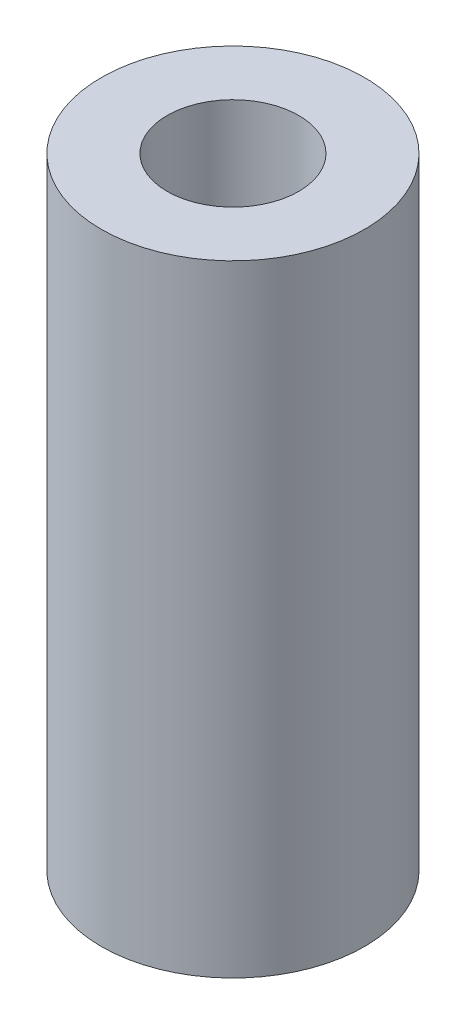
ISO-10303-21;
HEADER;
FILE_DESCRIPTION(('STEP AP214'),'2;1');
FILE_NAME('part.step','',(''),(''),'','','');
FILE_SCHEMA(('AUTOMOTIVE_DESIGN { 1 0 10303 214 1 1 1 1 }'));
ENDSEC;
DATA;
#1=APPLICATION_CONTEXT('core data for automotive mechanical design processes');
#2=APPLICATION_PROTOCOL_DEFINITION('international standard','automotive_design',2000,#1);
#3=PRODUCT_CONTEXT('',#1,'mechanical');
#4=PRODUCT('Part','Part','',(#3));
#5=PRODUCT_RELATED_PRODUCT_CATEGORY('part','',(#4));
#6=PRODUCT_DEFINITION_FORMATION('','',#4);
#7=PRODUCT_DEFINITION_CONTEXT('part definition',#1,'design');
#8=PRODUCT_DEFINITION('design','',#6,#7);
#9=PRODUCT_DEFINITION_SHAPE('','',#8);
#10=(LENGTH_UNIT() NAMED_UNIT(*) SI_UNIT(.MILLI.,.METRE.));
#11=(NAMED_UNIT(*) PLANE_ANGLE_UNIT() SI_UNIT($,.RADIAN.));
#12=(NAMED_UNIT(*) SI_UNIT($,.STERADIAN.) SOLID_ANGLE_UNIT());
#13=UNCERTAINTY_MEASURE_WITH_UNIT(LENGTH_MEASURE(1.E-05),#10,'distance_accuracy_value','');
#14=(GEOMETRIC_REPRESENTATION_CONTEXT(3) GLOBAL_UNCERTAINTY_ASSIGNED_CONTEXT((#13)) GLOBAL_UNIT_ASSIGNED_CONTEXT((#10,
#11,#12)) REPRESENTATION_CONTEXT('',''));
#15=CARTESIAN_POINT('',(0.,0.,0.));
#16=DIRECTION('',(0.,0.,1.));
#17=DIRECTION('',(1.,0.,0.));
#18=AXIS2_PLACEMENT_3D('',#15,#16,#17);
#19=CARTESIAN_POINT('',(0.,70.8100118508422,0.));
#20=DIRECTION('',(0.,-1.,0.));
#21=DIRECTION('',(0.,0.,-1.));
#22=AXIS2_PLACEMENT_3D('',#19,#20,#21);
#23=CYLINDRICAL_SURFACE('',#22,15.);
#24=CARTESIAN_POINT('',(0.,70.8100118508422,0.));
#25=DIRECTION('',(0.,1.,0.));
#26=DIRECTION('',(0.,0.,1.));
#27=AXIS2_PLACEMENT_3D('',#24,#25,#26);
#28=CIRCLE('',#27,15.);
#29=CARTESIAN_POINT('',(0.,70.8100118508422,15.));
#30=VERTEX_POINT('',#29);
#31=EDGE_CURVE('E10',#30,#30,#28,.T.);
#32=ORIENTED_EDGE('',*,*,#31,.F.);
#33=EDGE_LOOP('',(#32));
#34=FACE_BOUND('',#33,.T.);
#35=CARTESIAN_POINT('',(0.,0.,0.));
#36=DIRECTION('',(0.,1.,0.));
#37=DIRECTION('',(0.,0.,1.));
#38=AXIS2_PLACEMENT_3D('',#35,#36,#37);
#39=CIRCLE('',#38,15.);
#40=CARTESIAN_POINT('',(0.,0.,15.));
#41=VERTEX_POINT('',#40);
#42=EDGE_CURVE('E37',#41,#41,#39,.T.);
#43=ORIENTED_EDGE('',*,*,#42,.T.);
#44=EDGE_LOOP('',(#43));
#45=FACE_BOUND('',#44,.T.);
#46=ADVANCED_FACE('F40',(#34,#45),#23,.T.);
#47=CARTESIAN_POINT('',(0.,70.8100118508422,0.));
#48=DIRECTION('',(0.,1.,0.));
#49=DIRECTION('',(0.,0.,1.));
#50=AXIS2_PLACEMENT_3D('',#47,#48,#49);
#51=PLANE('',#50);
#52=CARTESIAN_POINT('',(0.,70.8100118508422,0.));
#53=DIRECTION('',(0.,1.,0.));
#54=DIRECTION('',(0.,0.,1.));
#55=AXIS2_PLACEMENT_3D('',#52,#53,#54);
#56=CIRCLE('',#55,7.50344410588236);
#57=CARTESIAN_POINT('',(0.,70.8100118508422,7.50344410588236));
#58=VERTEX_POINT('',#57);
#59=EDGE_CURVE('E50',#58,#58,#56,.T.);
#60=ORIENTED_EDGE('',*,*,#59,.F.);
#61=EDGE_LOOP('',(#60));
#62=FACE_BOUND('',#61,.T.);
#63=ORIENTED_EDGE('',*,*,#31,.T.);
#64=EDGE_LOOP('',(#63));
#65=FACE_BOUND('',#64,.T.);
#66=ADVANCED_FACE('F59',(#62,#65),#51,.T.);
#67=CARTESIAN_POINT('',(0.,0.,0.));
#68=DIRECTION('',(0.,1.,0.));
#69=DIRECTION('',(0.,0.,1.));
#70=AXIS2_PLACEMENT_3D('',#67,#68,#69);
#71=PLANE('',#70);
#72=CARTESIAN_POINT('',(0.,0.,0.));
#73=DIRECTION('',(0.,1.,0.));
#74=DIRECTION('',(0.,0.,1.));
#75=AXIS2_PLACEMENT_3D('',#72,#73,#74);
#76=CIRCLE('',#75,7.50344410588236);
#77=CARTESIAN_POINT('',(0.,0.,7.50344410588236));
#78=VERTEX_POINT('',#77);
#79=EDGE_CURVE('E47',#78,#78,#76,.T.);
#80=ORIENTED_EDGE('',*,*,#79,.T.);
#81=EDGE_LOOP('',(#80));
#82=FACE_BOUND('',#81,.T.);
#83=ORIENTED_EDGE('',*,*,#42,.F.);
#84=EDGE_LOOP('',(#83));
#85=FACE_BOUND('',#84,.T.);
#86=ADVANCED_FACE('F58',(#82,#85),#71,.F.);
#87=CARTESIAN_POINT('',(0.,70.8100118508422,0.));
#88=DIRECTION('',(0.,-1.,0.));
#89=DIRECTION('',(0.,0.,-1.));
#90=AXIS2_PLACEMENT_3D('',#87,#88,#89);
#91=CYLINDRICAL_SURFACE('',#90,7.50344410588236);
#92=ORIENTED_EDGE('',*,*,#59,.T.);
#93=EDGE_LOOP('',(#92));
#94=FACE_BOUND('',#93,.T.);
#95=ORIENTED_EDGE('',*,*,#79,.F.);
#96=EDGE_LOOP('',(#95));
#97=FACE_BOUND('',#96,.T.);
#98=ADVANCED_FACE('F54',(#94,#97),#91,.F.);
#99=CLOSED_SHELL('',(#46,#66,#86,#98));
#100=MANIFOLD_SOLID_BREP('B2',#99);
#101=ADVANCED_BREP_SHAPE_REPRESENTATION('',(#18,#100),#14);
#102=SHAPE_DEFINITION_REPRESENTATION(#9,#101);
ENDSEC;
END-ISO-10303-21;
